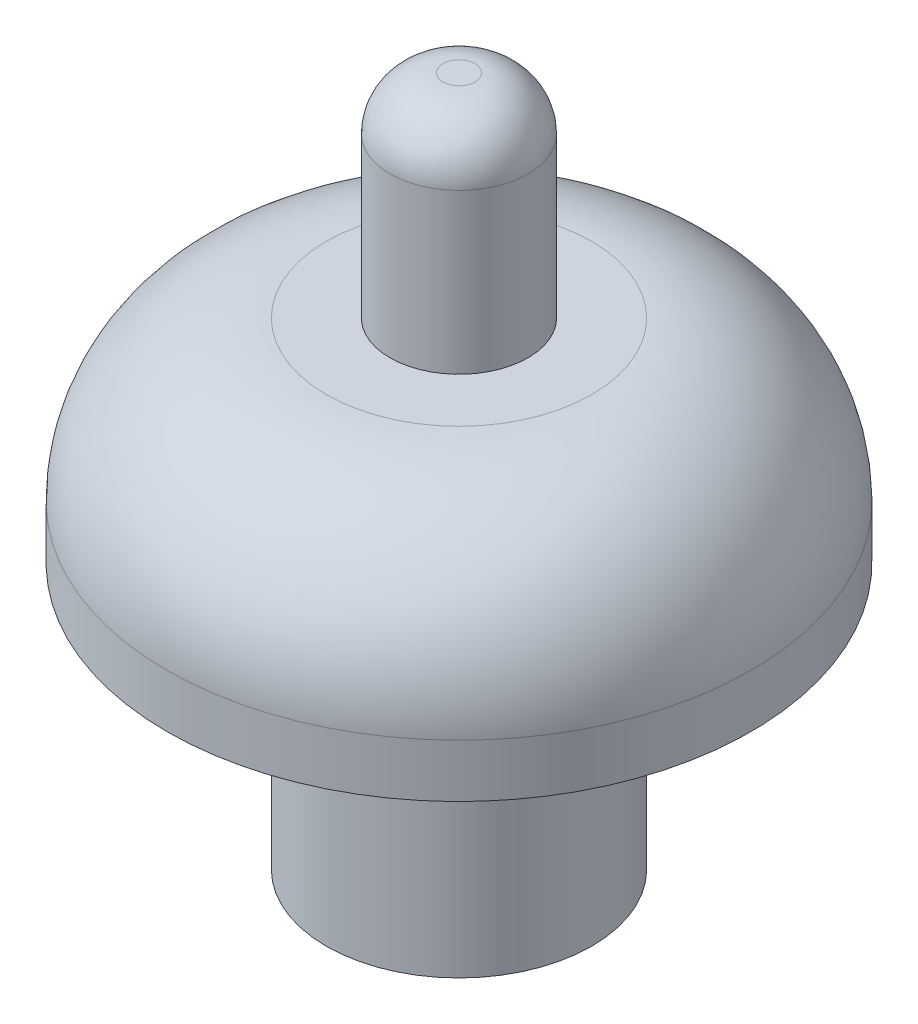
ISO-10303-21;
HEADER;
FILE_DESCRIPTION(('STEP AP214'),'2;1');
FILE_NAME('part.step','',(''),(''),'','','');
FILE_SCHEMA(('AUTOMOTIVE_DESIGN { 1 0 10303 214 1 1 1 1 }'));
ENDSEC;
DATA;
#1=APPLICATION_CONTEXT('core data for automotive mechanical design processes');
#2=APPLICATION_PROTOCOL_DEFINITION('international standard','automotive_design',2000,#1);
#3=PRODUCT_CONTEXT('',#1,'mechanical');
#4=PRODUCT('Part','Part','',(#3));
#5=PRODUCT_RELATED_PRODUCT_CATEGORY('part','',(#4));
#6=PRODUCT_DEFINITION_FORMATION('','',#4);
#7=PRODUCT_DEFINITION_CONTEXT('part definition',#1,'design');
#8=PRODUCT_DEFINITION('design','',#6,#7);
#9=PRODUCT_DEFINITION_SHAPE('','',#8);
#10=(LENGTH_UNIT() NAMED_UNIT(*) SI_UNIT(.MILLI.,.METRE.));
#11=(NAMED_UNIT(*) PLANE_ANGLE_UNIT() SI_UNIT($,.RADIAN.));
#12=(NAMED_UNIT(*) SI_UNIT($,.STERADIAN.) SOLID_ANGLE_UNIT());
#13=UNCERTAINTY_MEASURE_WITH_UNIT(LENGTH_MEASURE(1.E-05),#10,'distance_accuracy_value','');
#14=(GEOMETRIC_REPRESENTATION_CONTEXT(3) GLOBAL_UNCERTAINTY_ASSIGNED_CONTEXT((#13)) GLOBAL_UNIT_ASSIGNED_CONTEXT((#10,
#11,#12)) REPRESENTATION_CONTEXT('',''));
#15=CARTESIAN_POINT('',(0.,0.,0.));
#16=DIRECTION('',(0.,0.,1.));
#17=DIRECTION('',(1.,0.,0.));
#18=AXIS2_PLACEMENT_3D('',#15,#16,#17);
#19=CARTESIAN_POINT('',(0.,9.,0.));
#20=DIRECTION('',(0.,-1.,0.));
#21=DIRECTION('',(0.,0.,-1.));
#22=AXIS2_PLACEMENT_3D('',#19,#20,#21);
#23=CYLINDRICAL_SURFACE('',#22,2.5);
#24=CARTESIAN_POINT('',(0.,0.,0.));
#25=DIRECTION('',(0.,1.,0.));
#26=DIRECTION('',(0.,0.,1.));
#27=AXIS2_PLACEMENT_3D('',#24,#25,#26);
#28=CIRCLE('',#27,2.5);
#29=CARTESIAN_POINT('',(0.,0.,2.5));
#30=VERTEX_POINT('',#29);
#31=EDGE_CURVE('E49',#30,#30,#28,.T.);
#32=ORIENTED_EDGE('',*,*,#31,.T.);
#33=EDGE_LOOP('',(#32));
#34=FACE_BOUND('',#33,.T.);
#35=CARTESIAN_POINT('',(0.,5.,0.));
#36=DIRECTION('',(0.,1.,0.));
#37=DIRECTION('',(0.,0.,1.));
#38=AXIS2_PLACEMENT_3D('',#35,#36,#37);
#39=CIRCLE('',#38,2.5);
#40=CARTESIAN_POINT('',(0.,5.,2.5));
#41=VERTEX_POINT('',#40);
#42=EDGE_CURVE('E45',#41,#41,#39,.T.);
#43=ORIENTED_EDGE('',*,*,#42,.F.);
#44=EDGE_LOOP('',(#43));
#45=FACE_BOUND('',#44,.T.);
#46=ADVANCED_FACE('F34',(#34,#45),#23,.T.);
#47=CARTESIAN_POINT('',(0.,9.,0.));
#48=DIRECTION('',(0.,-1.,0.));
#49=DIRECTION('',(0.,0.,-1.));
#50=AXIS2_PLACEMENT_3D('',#47,#48,#49);
#51=CYLINDRICAL_SURFACE('',#50,2.);
#52=CARTESIAN_POINT('',(0.,0.,0.));
#53=DIRECTION('',(0.,1.,0.));
#54=DIRECTION('',(0.,0.,1.));
#55=AXIS2_PLACEMENT_3D('',#52,#53,#54);
#56=CIRCLE('',#55,2.);
#57=CARTESIAN_POINT('',(0.,0.,2.));
#58=VERTEX_POINT('',#57);
#59=EDGE_CURVE('E55',#58,#58,#56,.T.);
#60=ORIENTED_EDGE('',*,*,#59,.F.);
#61=EDGE_LOOP('',(#60));
#62=FACE_BOUND('',#61,.T.);
#63=CARTESIAN_POINT('',(0.,5.,0.));
#64=DIRECTION('',(0.,1.,0.));
#65=DIRECTION('',(0.,0.,1.));
#66=AXIS2_PLACEMENT_3D('',#63,#64,#65);
#67=CIRCLE('',#66,2.);
#68=CARTESIAN_POINT('',(0.,5.,2.));
#69=VERTEX_POINT('',#68);
#70=EDGE_CURVE('E52',#69,#69,#67,.T.);
#71=ORIENTED_EDGE('',*,*,#70,.T.);
#72=EDGE_LOOP('',(#71));
#73=FACE_BOUND('',#72,.T.);
#74=ADVANCED_FACE('F97',(#62,#73),#51,.F.);
#75=CARTESIAN_POINT('',(0.,0.,0.));
#76=DIRECTION('',(0.,1.,0.));
#77=DIRECTION('',(0.,0.,1.));
#78=AXIS2_PLACEMENT_3D('',#75,#76,#77);
#79=PLANE('',#78);
#80=ORIENTED_EDGE('',*,*,#31,.F.);
#81=EDGE_LOOP('',(#80));
#82=FACE_BOUND('',#81,.T.);
#83=ORIENTED_EDGE('',*,*,#59,.T.);
#84=EDGE_LOOP('',(#83));
#85=FACE_BOUND('',#84,.T.);
#86=ADVANCED_FACE('F102',(#82,#85),#79,.F.);
#87=CARTESIAN_POINT('',(0.,5.,0.));
#88=DIRECTION('',(0.,1.,0.));
#89=DIRECTION('',(0.,0.,1.));
#90=AXIS2_PLACEMENT_3D('',#87,#88,#89);
#91=PLANE('',#90);
#92=ORIENTED_EDGE('',*,*,#70,.F.);
#93=EDGE_LOOP('',(#92));
#94=FACE_BOUND('',#93,.T.);
#95=ADVANCED_FACE('F92',(#94),#91,.F.);
#96=CARTESIAN_POINT('',(0.,5.,0.));
#97=DIRECTION('',(0.,1.,0.));
#98=DIRECTION('',(0.,0.,1.));
#99=AXIS2_PLACEMENT_3D('',#96,#97,#98);
#100=CYLINDRICAL_SURFACE('',#99,5.5);
#101=CARTESIAN_POINT('',(0.,6.,0.));
#102=DIRECTION('',(0.,1.,0.));
#103=DIRECTION('',(0.,0.,1.));
#104=AXIS2_PLACEMENT_3D('',#101,#102,#103);
#105=CIRCLE('',#104,5.5);
#106=CARTESIAN_POINT('',(0.,6.,5.5));
#107=VERTEX_POINT('',#106);
#108=EDGE_CURVE('E56',#107,#107,#105,.F.);
#109=ORIENTED_EDGE('',*,*,#108,.T.);
#110=EDGE_LOOP('',(#109));
#111=FACE_BOUND('',#110,.T.);
#112=CARTESIAN_POINT('',(0.,5.,0.));
#113=DIRECTION('',(0.,1.,0.));
#114=DIRECTION('',(0.,0.,1.));
#115=AXIS2_PLACEMENT_3D('',#112,#113,#114);
#116=CIRCLE('',#115,5.5);
#117=CARTESIAN_POINT('',(0.,5.,5.5));
#118=VERTEX_POINT('',#117);
#119=EDGE_CURVE('E66',#118,#118,#116,.T.);
#120=ORIENTED_EDGE('',*,*,#119,.T.);
#121=EDGE_LOOP('',(#120));
#122=FACE_BOUND('',#121,.T.);
#123=ADVANCED_FACE('F89',(#111,#122),#100,.T.);
#124=ORIENTED_EDGE('',*,*,#42,.T.);
#125=EDGE_LOOP('',(#124));
#126=FACE_BOUND('',#125,.T.);
#127=ORIENTED_EDGE('',*,*,#119,.F.);
#128=EDGE_LOOP('',(#127));
#129=FACE_BOUND('',#128,.T.);
#130=ADVANCED_FACE('F83',(#126,#129),#91,.F.);
#131=CARTESIAN_POINT('',(0.,6.,0.));
#132=DIRECTION('',(0.,1.,0.));
#133=DIRECTION('',(0.,0.,1.));
#134=AXIS2_PLACEMENT_3D('',#131,#132,#133);
#135=DEGENERATE_TOROIDAL_SURFACE('',#134,2.5,3.,.T.);
#136=ORIENTED_EDGE('',*,*,#108,.F.);
#137=EDGE_LOOP('',(#136));
#138=FACE_BOUND('',#137,.T.);
#139=CARTESIAN_POINT('',(0.,9.,0.));
#140=DIRECTION('',(0.,1.,0.));
#141=DIRECTION('',(0.,0.,1.));
#142=AXIS2_PLACEMENT_3D('',#139,#140,#141);
#143=CIRCLE('',#142,2.5);
#144=CARTESIAN_POINT('',(0.,9.,2.5));
#145=VERTEX_POINT('',#144);
#146=EDGE_CURVE('E63',#145,#145,#143,.T.);
#147=ORIENTED_EDGE('',*,*,#146,.F.);
#148=EDGE_LOOP('',(#147));
#149=FACE_BOUND('',#148,.T.);
#150=ADVANCED_FACE('F78',(#138,#149),#135,.T.);
#151=CARTESIAN_POINT('',(0.,9.,0.));
#152=DIRECTION('',(0.,1.,0.));
#153=DIRECTION('',(0.,0.,1.));
#154=AXIS2_PLACEMENT_3D('',#151,#152,#153);
#155=PLANE('',#154);
#156=CARTESIAN_POINT('',(0.,9.,0.));
#157=DIRECTION('',(0.,1.,0.));
#158=DIRECTION('',(0.,0.,1.));
#159=AXIS2_PLACEMENT_3D('',#156,#157,#158);
#160=CIRCLE('',#159,1.30023658612873);
#161=CARTESIAN_POINT('',(0.,9.,1.30023658612873));
#162=VERTEX_POINT('',#161);
#163=EDGE_CURVE('E69',#162,#162,#160,.T.);
#164=ORIENTED_EDGE('',*,*,#163,.F.);
#165=EDGE_LOOP('',(#164));
#166=FACE_BOUND('',#165,.T.);
#167=ORIENTED_EDGE('',*,*,#146,.T.);
#168=EDGE_LOOP('',(#167));
#169=FACE_BOUND('',#168,.T.);
#170=ADVANCED_FACE('F75',(#166,#169),#155,.T.);
#171=CARTESIAN_POINT('',(0.,13.,0.));
#172=DIRECTION('',(0.,-1.,0.));
#173=DIRECTION('',(0.,0.,-1.));
#174=AXIS2_PLACEMENT_3D('',#171,#172,#173);
#175=CYLINDRICAL_SURFACE('',#174,1.30023658612873);
#176=CARTESIAN_POINT('',(0.,12.,0.));
#177=DIRECTION('',(0.,1.,0.));
#178=DIRECTION('',(0.,0.,1.));
#179=AXIS2_PLACEMENT_3D('',#176,#177,#178);
#180=CIRCLE('',#179,1.30023658612873);
#181=CARTESIAN_POINT('',(0.,12.,1.30023658612873));
#182=VERTEX_POINT('',#181);
#183=EDGE_CURVE('E10',#182,#182,#180,.F.);
#184=ORIENTED_EDGE('',*,*,#183,.T.);
#185=EDGE_LOOP('',(#184));
#186=FACE_BOUND('',#185,.T.);
#187=ORIENTED_EDGE('',*,*,#163,.T.);
#188=EDGE_LOOP('',(#187));
#189=FACE_BOUND('',#188,.T.);
#190=ADVANCED_FACE('F73',(#186,#189),#175,.T.);
#191=CARTESIAN_POINT('',(0.,13.,0.));
#192=DIRECTION('',(0.,1.,0.));
#193=DIRECTION('',(0.,0.,1.));
#194=AXIS2_PLACEMENT_3D('',#191,#192,#193);
#195=PLANE('',#194);
#196=CARTESIAN_POINT('',(0.,13.,0.));
#197=DIRECTION('',(0.,1.,0.));
#198=DIRECTION('',(0.,0.,1.));
#199=AXIS2_PLACEMENT_3D('',#196,#197,#198);
#200=CIRCLE('',#199,0.300236586128728);
#201=CARTESIAN_POINT('',(0.,13.,0.300236586128728));
#202=VERTEX_POINT('',#201);
#203=EDGE_CURVE('E41',#202,#202,#200,.T.);
#204=ORIENTED_EDGE('',*,*,#203,.T.);
#205=EDGE_LOOP('',(#204));
#206=FACE_BOUND('',#205,.T.);
#207=ADVANCED_FACE('F124',(#206),#195,.T.);
#208=CARTESIAN_POINT('',(0.,12.,0.));
#209=DIRECTION('',(0.,1.,0.));
#210=DIRECTION('',(0.,0.,1.));
#211=AXIS2_PLACEMENT_3D('',#208,#209,#210);
#212=DEGENERATE_TOROIDAL_SURFACE('',#211,0.300236586128728,1.,.T.);
#213=ORIENTED_EDGE('',*,*,#183,.F.);
#214=EDGE_LOOP('',(#213));
#215=FACE_BOUND('',#214,.T.);
#216=ORIENTED_EDGE('',*,*,#203,.F.);
#217=EDGE_LOOP('',(#216));
#218=FACE_BOUND('',#217,.T.);
#219=ADVANCED_FACE('F36',(#215,#218),#212,.T.);
#220=CLOSED_SHELL('',(#46,#74,#86,#95,#123,#130,#150,#170,#190,#207,#219));
#221=MANIFOLD_SOLID_BREP('B2',#220);
#222=ADVANCED_BREP_SHAPE_REPRESENTATION('',(#18,#221),#14);
#223=SHAPE_DEFINITION_REPRESENTATION(#9,#222);
ENDSEC;
END-ISO-10303-21;
